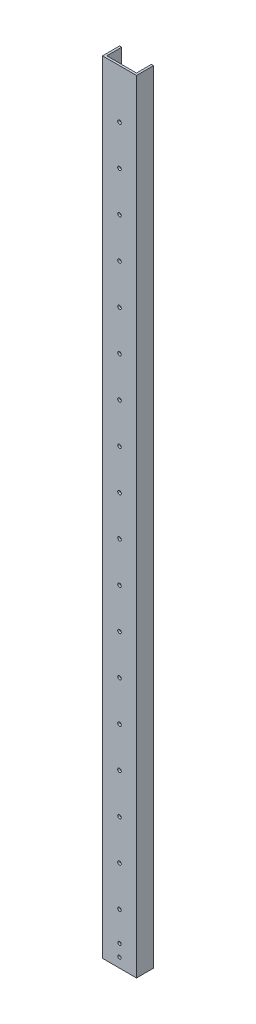
ISO-10303-21;
HEADER;
FILE_DESCRIPTION(('STEP AP214'),'2;1');
FILE_NAME('part.step','',(''),(''),'','','');
FILE_SCHEMA(('AUTOMOTIVE_DESIGN { 1 0 10303 214 1 1 1 1 }'));
ENDSEC;
DATA;
#1=APPLICATION_CONTEXT('core data for automotive mechanical design processes');
#2=APPLICATION_PROTOCOL_DEFINITION('international standard','automotive_design',2000,#1);
#3=PRODUCT_CONTEXT('',#1,'mechanical');
#4=PRODUCT('Part','Part','',(#3));
#5=PRODUCT_RELATED_PRODUCT_CATEGORY('part','',(#4));
#6=PRODUCT_DEFINITION_FORMATION('','',#4);
#7=PRODUCT_DEFINITION_CONTEXT('part definition',#1,'design');
#8=PRODUCT_DEFINITION('design','',#6,#7);
#9=PRODUCT_DEFINITION_SHAPE('','',#8);
#10=(LENGTH_UNIT() NAMED_UNIT(*) SI_UNIT(.MILLI.,.METRE.));
#11=(NAMED_UNIT(*) PLANE_ANGLE_UNIT() SI_UNIT($,.RADIAN.));
#12=(NAMED_UNIT(*) SI_UNIT($,.STERADIAN.) SOLID_ANGLE_UNIT());
#13=UNCERTAINTY_MEASURE_WITH_UNIT(LENGTH_MEASURE(1.E-05),#10,'distance_accuracy_value','');
#14=(GEOMETRIC_REPRESENTATION_CONTEXT(3) GLOBAL_UNCERTAINTY_ASSIGNED_CONTEXT((#13)) GLOBAL_UNIT_ASSIGNED_CONTEXT((#10,
#11,#12)) REPRESENTATION_CONTEXT('',''));
#15=CARTESIAN_POINT('',(0.,0.,0.));
#16=DIRECTION('',(0.,0.,1.));
#17=DIRECTION('',(1.,0.,0.));
#18=AXIS2_PLACEMENT_3D('',#15,#16,#17);
#19=CARTESIAN_POINT('',(0.,1168.4,0.));
#20=DIRECTION('',(1.,0.,0.));
#21=DIRECTION('',(0.,0.,-1.));
#22=AXIS2_PLACEMENT_3D('',#19,#20,#21);
#23=PLANE('',#22);
#24=DIRECTION('',(0.,0.,1.));
#25=VECTOR('',#24,1.);
#26=CARTESIAN_POINT('',(0.,0.,0.));
#27=LINE('',#26,#25);
#28=CARTESIAN_POINT('',(0.,0.,-25.4));
#29=VERTEX_POINT('',#28);
#30=CARTESIAN_POINT('',(0.,0.,0.));
#31=VERTEX_POINT('',#30);
#32=EDGE_CURVE('E147',#29,#31,#27,.T.);
#33=ORIENTED_EDGE('',*,*,#32,.T.);
#34=DIRECTION('',(0.,-1.,0.));
#35=VECTOR('',#34,1.);
#36=CARTESIAN_POINT('',(0.,1168.4,0.));
#37=LINE('',#36,#35);
#38=CARTESIAN_POINT('',(0.,1168.4,0.));
#39=VERTEX_POINT('',#38);
#40=EDGE_CURVE('E12',#39,#31,#37,.T.);
#41=ORIENTED_EDGE('',*,*,#40,.F.);
#42=DIRECTION('',(0.,0.,1.));
#43=VECTOR('',#42,1.);
#44=CARTESIAN_POINT('',(0.,1168.4,0.));
#45=LINE('',#44,#43);
#46=CARTESIAN_POINT('',(0.,1168.4,-25.4));
#47=VERTEX_POINT('',#46);
#48=EDGE_CURVE('E170',#47,#39,#45,.T.);
#49=ORIENTED_EDGE('',*,*,#48,.F.);
#50=DIRECTION('',(0.,-1.,0.));
#51=VECTOR('',#50,1.);
#52=CARTESIAN_POINT('',(0.,1168.4,-25.4));
#53=LINE('',#52,#51);
#54=EDGE_CURVE('E143',#47,#29,#53,.T.);
#55=ORIENTED_EDGE('',*,*,#54,.T.);
#56=EDGE_LOOP('',(#33,#41,#49,#55));
#57=FACE_BOUND('',#56,.T.);
#58=ADVANCED_FACE('F41',(#57),#23,.F.);
#59=CARTESIAN_POINT('',(0.,1168.4,0.));
#60=DIRECTION('',(0.,0.,-1.));
#61=DIRECTION('',(-1.,0.,0.));
#62=AXIS2_PLACEMENT_3D('',#59,#60,#61);
#63=PLANE('',#62);
#64=CARTESIAN_POINT('',(25.4000000000003,32.1310000000016,0.));
#65=DIRECTION('',(0.,0.,1.));
#66=DIRECTION('',(1.,0.,0.));
#67=AXIS2_PLACEMENT_3D('',#64,#65,#66);
#68=CIRCLE('',#67,2.5527);
#69=CARTESIAN_POINT('',(27.9527000000003,32.1310000000016,0.));
#70=VERTEX_POINT('',#69);
#71=EDGE_CURVE('E347',#70,#70,#68,.T.);
#72=ORIENTED_EDGE('',*,*,#71,.F.);
#73=EDGE_LOOP('',(#72));
#74=FACE_BOUND('',#73,.T.);
#75=CARTESIAN_POINT('',(25.4000000000003,14.2875000000016,0.));
#76=DIRECTION('',(0.,0.,1.));
#77=DIRECTION('',(1.,0.,0.));
#78=AXIS2_PLACEMENT_3D('',#75,#76,#77);
#79=CIRCLE('',#78,2.5527);
#80=CARTESIAN_POINT('',(27.9527000000003,14.2875000000016,0.));
#81=VERTEX_POINT('',#80);
#82=EDGE_CURVE('E348',#81,#81,#79,.T.);
#83=ORIENTED_EDGE('',*,*,#82,.F.);
#84=EDGE_LOOP('',(#83));
#85=FACE_BOUND('',#84,.T.);
#86=CARTESIAN_POINT('',(25.4,76.2,0.));
#87=DIRECTION('',(0.,0.,1.));
#88=DIRECTION('',(1.,0.,0.));
#89=AXIS2_PLACEMENT_3D('',#86,#87,#88);
#90=CIRCLE('',#89,2.667);
#91=CARTESIAN_POINT('',(28.067,76.2,0.));
#92=VERTEX_POINT('',#91);
#93=EDGE_CURVE('E338',#92,#92,#90,.T.);
#94=ORIENTED_EDGE('',*,*,#93,.F.);
#95=EDGE_LOOP('',(#94));
#96=FACE_BOUND('',#95,.T.);
#97=CARTESIAN_POINT('',(25.4,136.144,0.));
#98=DIRECTION('',(0.,0.,1.));
#99=DIRECTION('',(1.,0.,0.));
#100=AXIS2_PLACEMENT_3D('',#97,#98,#99);
#101=CIRCLE('',#100,2.667);
#102=CARTESIAN_POINT('',(28.067,136.144,0.));
#103=VERTEX_POINT('',#102);
#104=EDGE_CURVE('E322',#103,#103,#101,.T.);
#105=ORIENTED_EDGE('',*,*,#104,.F.);
#106=EDGE_LOOP('',(#105));
#107=FACE_BOUND('',#106,.T.);
#108=CARTESIAN_POINT('',(25.4,196.088,0.));
#109=DIRECTION('',(0.,0.,1.));
#110=DIRECTION('',(1.,0.,0.));
#111=AXIS2_PLACEMENT_3D('',#108,#109,#110);
#112=CIRCLE('',#111,2.667);
#113=CARTESIAN_POINT('',(28.067,196.088,0.));
#114=VERTEX_POINT('',#113);
#115=EDGE_CURVE('E312',#114,#114,#112,.T.);
#116=ORIENTED_EDGE('',*,*,#115,.F.);
#117=EDGE_LOOP('',(#116));
#118=FACE_BOUND('',#117,.T.);
#119=CARTESIAN_POINT('',(25.4,256.032,0.));
#120=DIRECTION('',(0.,0.,1.));
#121=DIRECTION('',(1.,0.,0.));
#122=AXIS2_PLACEMENT_3D('',#119,#120,#121);
#123=CIRCLE('',#122,2.667);
#124=CARTESIAN_POINT('',(28.067,256.032,0.));
#125=VERTEX_POINT('',#124);
#126=EDGE_CURVE('E313',#125,#125,#123,.T.);
#127=ORIENTED_EDGE('',*,*,#126,.F.);
#128=EDGE_LOOP('',(#127));
#129=FACE_BOUND('',#128,.T.);
#130=CARTESIAN_POINT('',(25.4,315.976,0.));
#131=DIRECTION('',(0.,0.,1.));
#132=DIRECTION('',(1.,0.,0.));
#133=AXIS2_PLACEMENT_3D('',#130,#131,#132);
#134=CIRCLE('',#133,2.667);
#135=CARTESIAN_POINT('',(28.067,315.976,0.));
#136=VERTEX_POINT('',#135);
#137=EDGE_CURVE('E293',#136,#136,#134,.T.);
#138=ORIENTED_EDGE('',*,*,#137,.F.);
#139=EDGE_LOOP('',(#138));
#140=FACE_BOUND('',#139,.T.);
#141=CARTESIAN_POINT('',(25.4,375.92,0.));
#142=DIRECTION('',(0.,0.,1.));
#143=DIRECTION('',(1.,0.,0.));
#144=AXIS2_PLACEMENT_3D('',#141,#142,#143);
#145=CIRCLE('',#144,2.667);
#146=CARTESIAN_POINT('',(28.067,375.92,0.));
#147=VERTEX_POINT('',#146);
#148=EDGE_CURVE('E285',#147,#147,#145,.T.);
#149=ORIENTED_EDGE('',*,*,#148,.F.);
#150=EDGE_LOOP('',(#149));
#151=FACE_BOUND('',#150,.T.);
#152=CARTESIAN_POINT('',(25.4,435.864,0.));
#153=DIRECTION('',(0.,0.,1.));
#154=DIRECTION('',(1.,0.,0.));
#155=AXIS2_PLACEMENT_3D('',#152,#153,#154);
#156=CIRCLE('',#155,2.667);
#157=CARTESIAN_POINT('',(28.067,435.864,0.));
#158=VERTEX_POINT('',#157);
#159=EDGE_CURVE('E277',#158,#158,#156,.T.);
#160=ORIENTED_EDGE('',*,*,#159,.F.);
#161=EDGE_LOOP('',(#160));
#162=FACE_BOUND('',#161,.T.);
#163=CARTESIAN_POINT('',(25.4,495.808,0.));
#164=DIRECTION('',(0.,0.,1.));
#165=DIRECTION('',(1.,0.,0.));
#166=AXIS2_PLACEMENT_3D('',#163,#164,#165);
#167=CIRCLE('',#166,2.667);
#168=CARTESIAN_POINT('',(28.067,495.808,0.));
#169=VERTEX_POINT('',#168);
#170=EDGE_CURVE('E269',#169,#169,#167,.T.);
#171=ORIENTED_EDGE('',*,*,#170,.F.);
#172=EDGE_LOOP('',(#171));
#173=FACE_BOUND('',#172,.T.);
#174=CARTESIAN_POINT('',(25.4,555.752,0.));
#175=DIRECTION('',(0.,0.,1.));
#176=DIRECTION('',(1.,0.,0.));
#177=AXIS2_PLACEMENT_3D('',#174,#175,#176);
#178=CIRCLE('',#177,2.667);
#179=CARTESIAN_POINT('',(28.067,555.752,0.));
#180=VERTEX_POINT('',#179);
#181=EDGE_CURVE('E263',#180,#180,#178,.T.);
#182=ORIENTED_EDGE('',*,*,#181,.F.);
#183=EDGE_LOOP('',(#182));
#184=FACE_BOUND('',#183,.T.);
#185=CARTESIAN_POINT('',(25.4,615.696,0.));
#186=DIRECTION('',(0.,0.,1.));
#187=DIRECTION('',(1.,0.,0.));
#188=AXIS2_PLACEMENT_3D('',#185,#186,#187);
#189=CIRCLE('',#188,2.66699999999997);
#190=CARTESIAN_POINT('',(28.067,615.696,0.));
#191=VERTEX_POINT('',#190);
#192=EDGE_CURVE('E257',#191,#191,#189,.T.);
#193=ORIENTED_EDGE('',*,*,#192,.F.);
#194=EDGE_LOOP('',(#193));
#195=FACE_BOUND('',#194,.T.);
#196=CARTESIAN_POINT('',(25.4,675.64,0.));
#197=DIRECTION('',(0.,0.,1.));
#198=DIRECTION('',(1.,0.,0.));
#199=AXIS2_PLACEMENT_3D('',#196,#197,#198);
#200=CIRCLE('',#199,2.66699999999995);
#201=CARTESIAN_POINT('',(28.0669999999999,675.64,0.));
#202=VERTEX_POINT('',#201);
#203=EDGE_CURVE('E251',#202,#202,#200,.T.);
#204=ORIENTED_EDGE('',*,*,#203,.F.);
#205=EDGE_LOOP('',(#204));
#206=FACE_BOUND('',#205,.T.);
#207=CARTESIAN_POINT('',(25.4,735.584,0.));
#208=DIRECTION('',(0.,0.,1.));
#209=DIRECTION('',(1.,0.,0.));
#210=AXIS2_PLACEMENT_3D('',#207,#208,#209);
#211=CIRCLE('',#210,2.667);
#212=CARTESIAN_POINT('',(28.067,735.584,0.));
#213=VERTEX_POINT('',#212);
#214=EDGE_CURVE('E245',#213,#213,#211,.T.);
#215=ORIENTED_EDGE('',*,*,#214,.F.);
#216=EDGE_LOOP('',(#215));
#217=FACE_BOUND('',#216,.T.);
#218=CARTESIAN_POINT('',(25.4,795.528,0.));
#219=DIRECTION('',(0.,0.,1.));
#220=DIRECTION('',(1.,0.,0.));
#221=AXIS2_PLACEMENT_3D('',#218,#219,#220);
#222=CIRCLE('',#221,2.667);
#223=CARTESIAN_POINT('',(28.067,795.528,0.));
#224=VERTEX_POINT('',#223);
#225=EDGE_CURVE('E239',#224,#224,#222,.T.);
#226=ORIENTED_EDGE('',*,*,#225,.F.);
#227=EDGE_LOOP('',(#226));
#228=FACE_BOUND('',#227,.T.);
#229=CARTESIAN_POINT('',(25.4,855.472,0.));
#230=DIRECTION('',(0.,0.,1.));
#231=DIRECTION('',(1.,0.,0.));
#232=AXIS2_PLACEMENT_3D('',#229,#230,#231);
#233=CIRCLE('',#232,2.667);
#234=CARTESIAN_POINT('',(28.067,855.472,0.));
#235=VERTEX_POINT('',#234);
#236=EDGE_CURVE('E233',#235,#235,#233,.T.);
#237=ORIENTED_EDGE('',*,*,#236,.F.);
#238=EDGE_LOOP('',(#237));
#239=FACE_BOUND('',#238,.T.);
#240=CARTESIAN_POINT('',(25.4,915.416,0.));
#241=DIRECTION('',(0.,0.,1.));
#242=DIRECTION('',(1.,0.,0.));
#243=AXIS2_PLACEMENT_3D('',#240,#241,#242);
#244=CIRCLE('',#243,2.667);
#245=CARTESIAN_POINT('',(28.067,915.416,0.));
#246=VERTEX_POINT('',#245);
#247=EDGE_CURVE('E227',#246,#246,#244,.T.);
#248=ORIENTED_EDGE('',*,*,#247,.F.);
#249=EDGE_LOOP('',(#248));
#250=FACE_BOUND('',#249,.T.);
#251=CARTESIAN_POINT('',(25.4,975.36,0.));
#252=DIRECTION('',(0.,0.,1.));
#253=DIRECTION('',(1.,0.,0.));
#254=AXIS2_PLACEMENT_3D('',#251,#252,#253);
#255=CIRCLE('',#254,2.66700000000003);
#256=CARTESIAN_POINT('',(28.067,975.36,0.));
#257=VERTEX_POINT('',#256);
#258=EDGE_CURVE('E221',#257,#257,#255,.T.);
#259=ORIENTED_EDGE('',*,*,#258,.F.);
#260=EDGE_LOOP('',(#259));
#261=FACE_BOUND('',#260,.T.);
#262=CARTESIAN_POINT('',(25.4,1035.304,0.));
#263=DIRECTION('',(0.,0.,1.));
#264=DIRECTION('',(1.,0.,0.));
#265=AXIS2_PLACEMENT_3D('',#262,#263,#264);
#266=CIRCLE('',#265,2.66700000000006);
#267=CARTESIAN_POINT('',(28.0670000000001,1035.304,0.));
#268=VERTEX_POINT('',#267);
#269=EDGE_CURVE('E213',#268,#268,#266,.T.);
#270=ORIENTED_EDGE('',*,*,#269,.F.);
#271=EDGE_LOOP('',(#270));
#272=FACE_BOUND('',#271,.T.);
#273=CARTESIAN_POINT('',(25.4,1095.248,0.));
#274=DIRECTION('',(0.,0.,1.));
#275=DIRECTION('',(1.,0.,0.));
#276=AXIS2_PLACEMENT_3D('',#273,#274,#275);
#277=CIRCLE('',#276,2.66700000000006);
#278=CARTESIAN_POINT('',(28.0670000000001,1095.248,0.));
#279=VERTEX_POINT('',#278);
#280=EDGE_CURVE('E214',#279,#279,#277,.T.);
#281=ORIENTED_EDGE('',*,*,#280,.F.);
#282=EDGE_LOOP('',(#281));
#283=FACE_BOUND('',#282,.T.);
#284=DIRECTION('',(1.,0.,0.));
#285=VECTOR('',#284,1.);
#286=CARTESIAN_POINT('',(0.,0.,0.));
#287=LINE('',#286,#285);
#288=CARTESIAN_POINT('',(50.8,0.,0.));
#289=VERTEX_POINT('',#288);
#290=EDGE_CURVE('E151',#31,#289,#287,.T.);
#291=ORIENTED_EDGE('',*,*,#290,.T.);
#292=DIRECTION('',(0.,-1.,0.));
#293=VECTOR('',#292,1.);
#294=CARTESIAN_POINT('',(50.8,1168.4,0.));
#295=LINE('',#294,#293);
#296=CARTESIAN_POINT('',(50.8,1168.4,0.));
#297=VERTEX_POINT('',#296);
#298=EDGE_CURVE('E50',#297,#289,#295,.T.);
#299=ORIENTED_EDGE('',*,*,#298,.F.);
#300=DIRECTION('',(1.,0.,0.));
#301=VECTOR('',#300,1.);
#302=CARTESIAN_POINT('',(0.,1168.4,0.));
#303=LINE('',#302,#301);
#304=EDGE_CURVE('E109',#39,#297,#303,.T.);
#305=ORIENTED_EDGE('',*,*,#304,.F.);
#306=ORIENTED_EDGE('',*,*,#40,.T.);
#307=EDGE_LOOP('',(#291,#299,#305,#306));
#308=FACE_BOUND('',#307,.T.);
#309=ADVANCED_FACE('F362',(#74,#85,#96,#107,#118,#129,#140,#151,#162,#173,#184,#195,#206,#217,
#228,#239,#250,#261,#272,#283,#308),#63,.F.);
#310=CARTESIAN_POINT('',(50.8,1168.4,0.));
#311=DIRECTION('',(-1.,0.,0.));
#312=DIRECTION('',(0.,0.,1.));
#313=AXIS2_PLACEMENT_3D('',#310,#311,#312);
#314=PLANE('',#313);
#315=DIRECTION('',(0.,0.,-1.));
#316=VECTOR('',#315,1.);
#317=CARTESIAN_POINT('',(50.8,0.,0.));
#318=LINE('',#317,#316);
#319=CARTESIAN_POINT('',(50.8,0.,-25.4));
#320=VERTEX_POINT('',#319);
#321=EDGE_CURVE('E155',#289,#320,#318,.T.);
#322=ORIENTED_EDGE('',*,*,#321,.T.);
#323=DIRECTION('',(0.,-1.,0.));
#324=VECTOR('',#323,1.);
#325=CARTESIAN_POINT('',(50.8,1168.4,-25.4));
#326=LINE('',#325,#324);
#327=CARTESIAN_POINT('',(50.8,1168.4,-25.4));
#328=VERTEX_POINT('',#327);
#329=EDGE_CURVE('E181',#328,#320,#326,.T.);
#330=ORIENTED_EDGE('',*,*,#329,.F.);
#331=DIRECTION('',(0.,0.,-1.));
#332=VECTOR('',#331,1.);
#333=CARTESIAN_POINT('',(50.8,1168.4,0.));
#334=LINE('',#333,#332);
#335=EDGE_CURVE('E192',#297,#328,#334,.T.);
#336=ORIENTED_EDGE('',*,*,#335,.F.);
#337=ORIENTED_EDGE('',*,*,#298,.T.);
#338=EDGE_LOOP('',(#322,#330,#336,#337));
#339=FACE_BOUND('',#338,.T.);
#340=ADVANCED_FACE('F190',(#339),#314,.F.);
#341=CARTESIAN_POINT('',(50.8,1168.4,-25.4));
#342=DIRECTION('',(0.,0.,1.));
#343=DIRECTION('',(1.,0.,0.));
#344=AXIS2_PLACEMENT_3D('',#341,#342,#343);
#345=PLANE('',#344);
#346=DIRECTION('',(-1.,0.,0.));
#347=VECTOR('',#346,1.);
#348=CARTESIAN_POINT('',(50.8,0.,-25.4));
#349=LINE('',#348,#347);
#350=CARTESIAN_POINT('',(47.625,0.,-25.4));
#351=VERTEX_POINT('',#350);
#352=EDGE_CURVE('E158',#320,#351,#349,.T.);
#353=ORIENTED_EDGE('',*,*,#352,.T.);
#354=DIRECTION('',(0.,-1.,0.));
#355=VECTOR('',#354,1.);
#356=CARTESIAN_POINT('',(47.625,1168.4,-25.4));
#357=LINE('',#356,#355);
#358=CARTESIAN_POINT('',(47.625,1168.4,-25.4));
#359=VERTEX_POINT('',#358);
#360=EDGE_CURVE('E177',#359,#351,#357,.T.);
#361=ORIENTED_EDGE('',*,*,#360,.F.);
#362=DIRECTION('',(-1.,0.,0.));
#363=VECTOR('',#362,1.);
#364=CARTESIAN_POINT('',(50.8,1168.4,-25.4));
#365=LINE('',#364,#363);
#366=EDGE_CURVE('E204',#328,#359,#365,.T.);
#367=ORIENTED_EDGE('',*,*,#366,.F.);
#368=ORIENTED_EDGE('',*,*,#329,.T.);
#369=EDGE_LOOP('',(#353,#361,#367,#368));
#370=FACE_BOUND('',#369,.T.);
#371=ADVANCED_FACE('F200',(#370),#345,.F.);
#372=CARTESIAN_POINT('',(47.625,1168.4,-3.175));
#373=DIRECTION('',(1.,0.,0.));
#374=DIRECTION('',(0.,0.,-1.));
#375=AXIS2_PLACEMENT_3D('',#372,#373,#374);
#376=PLANE('',#375);
#377=DIRECTION('',(0.,0.,1.));
#378=VECTOR('',#377,1.);
#379=CARTESIAN_POINT('',(47.625,0.,-3.175));
#380=LINE('',#379,#378);
#381=CARTESIAN_POINT('',(47.625,0.,-3.175));
#382=VERTEX_POINT('',#381);
#383=EDGE_CURVE('E161',#351,#382,#380,.T.);
#384=ORIENTED_EDGE('',*,*,#383,.T.);
#385=DIRECTION('',(0.,-1.,0.));
#386=VECTOR('',#385,1.);
#387=CARTESIAN_POINT('',(47.625,1168.4,-3.175));
#388=LINE('',#387,#386);
#389=CARTESIAN_POINT('',(47.625,1168.4,-3.175));
#390=VERTEX_POINT('',#389);
#391=EDGE_CURVE('E138',#390,#382,#388,.T.);
#392=ORIENTED_EDGE('',*,*,#391,.F.);
#393=DIRECTION('',(0.,0.,1.));
#394=VECTOR('',#393,1.);
#395=CARTESIAN_POINT('',(47.625,1168.4,-3.175));
#396=LINE('',#395,#394);
#397=EDGE_CURVE('E128',#359,#390,#396,.T.);
#398=ORIENTED_EDGE('',*,*,#397,.F.);
#399=ORIENTED_EDGE('',*,*,#360,.T.);
#400=EDGE_LOOP('',(#384,#392,#398,#399));
#401=FACE_BOUND('',#400,.T.);
#402=ADVANCED_FACE('F203',(#401),#376,.F.);
#403=CARTESIAN_POINT('',(3.175,1168.4,-3.175));
#404=DIRECTION('',(0.,0.,1.));
#405=DIRECTION('',(1.,0.,0.));
#406=AXIS2_PLACEMENT_3D('',#403,#404,#405);
#407=PLANE('',#406);
#408=CARTESIAN_POINT('',(25.4000000000003,32.1310000000016,-3.175));
#409=DIRECTION('',(0.,0.,1.));
#410=DIRECTION('',(1.,0.,0.));
#411=AXIS2_PLACEMENT_3D('',#408,#409,#410);
#412=CIRCLE('',#411,2.5527);
#413=CARTESIAN_POINT('',(27.9527000000003,32.1310000000016,-3.175));
#414=VERTEX_POINT('',#413);
#415=EDGE_CURVE('E217',#414,#414,#412,.F.);
#416=ORIENTED_EDGE('',*,*,#415,.F.);
#417=EDGE_LOOP('',(#416));
#418=FACE_BOUND('',#417,.T.);
#419=CARTESIAN_POINT('',(25.4000000000003,14.2875000000016,-3.175));
#420=DIRECTION('',(0.,0.,1.));
#421=DIRECTION('',(1.,0.,0.));
#422=AXIS2_PLACEMENT_3D('',#419,#420,#421);
#423=CIRCLE('',#422,2.5527);
#424=CARTESIAN_POINT('',(27.9527000000003,14.2875000000016,-3.175));
#425=VERTEX_POINT('',#424);
#426=EDGE_CURVE('E343',#425,#425,#423,.F.);
#427=ORIENTED_EDGE('',*,*,#426,.F.);
#428=EDGE_LOOP('',(#427));
#429=FACE_BOUND('',#428,.T.);
#430=CARTESIAN_POINT('',(25.4,76.2,-3.175));
#431=DIRECTION('',(0.,0.,1.));
#432=DIRECTION('',(1.,0.,0.));
#433=AXIS2_PLACEMENT_3D('',#430,#431,#432);
#434=CIRCLE('',#433,2.667);
#435=CARTESIAN_POINT('',(28.067,76.2,-3.175));
#436=VERTEX_POINT('',#435);
#437=EDGE_CURVE('E152',#436,#436,#434,.F.);
#438=ORIENTED_EDGE('',*,*,#437,.F.);
#439=EDGE_LOOP('',(#438));
#440=FACE_BOUND('',#439,.T.);
#441=CARTESIAN_POINT('',(25.4,136.144,-3.175));
#442=DIRECTION('',(0.,0.,1.));
#443=DIRECTION('',(1.,0.,0.));
#444=AXIS2_PLACEMENT_3D('',#441,#442,#443);
#445=CIRCLE('',#444,2.667);
#446=CARTESIAN_POINT('',(28.067,136.144,-3.175));
#447=VERTEX_POINT('',#446);
#448=EDGE_CURVE('E327',#447,#447,#445,.F.);
#449=ORIENTED_EDGE('',*,*,#448,.F.);
#450=EDGE_LOOP('',(#449));
#451=FACE_BOUND('',#450,.T.);
#452=CARTESIAN_POINT('',(25.4,196.088,-3.175));
#453=DIRECTION('',(0.,0.,1.));
#454=DIRECTION('',(1.,0.,0.));
#455=AXIS2_PLACEMENT_3D('',#452,#453,#454);
#456=CIRCLE('',#455,2.667);
#457=CARTESIAN_POINT('',(28.067,196.088,-3.175));
#458=VERTEX_POINT('',#457);
#459=EDGE_CURVE('E318',#458,#458,#456,.F.);
#460=ORIENTED_EDGE('',*,*,#459,.F.);
#461=EDGE_LOOP('',(#460));
#462=FACE_BOUND('',#461,.T.);
#463=CARTESIAN_POINT('',(25.4,256.032,-3.175));
#464=DIRECTION('',(0.,0.,1.));
#465=DIRECTION('',(1.,0.,0.));
#466=AXIS2_PLACEMENT_3D('',#463,#464,#465);
#467=CIRCLE('',#466,2.667);
#468=CARTESIAN_POINT('',(28.067,256.032,-3.175));
#469=VERTEX_POINT('',#468);
#470=EDGE_CURVE('E309',#469,#469,#467,.F.);
#471=ORIENTED_EDGE('',*,*,#470,.F.);
#472=EDGE_LOOP('',(#471));
#473=FACE_BOUND('',#472,.T.);
#474=CARTESIAN_POINT('',(25.4,315.976,-3.175));
#475=DIRECTION('',(0.,0.,1.));
#476=DIRECTION('',(1.,0.,0.));
#477=AXIS2_PLACEMENT_3D('',#474,#475,#476);
#478=CIRCLE('',#477,2.667);
#479=CARTESIAN_POINT('',(28.067,315.976,-3.175));
#480=VERTEX_POINT('',#479);
#481=EDGE_CURVE('E298',#480,#480,#478,.F.);
#482=ORIENTED_EDGE('',*,*,#481,.F.);
#483=EDGE_LOOP('',(#482));
#484=FACE_BOUND('',#483,.T.);
#485=CARTESIAN_POINT('',(25.4,375.92,-3.175));
#486=DIRECTION('',(0.,0.,1.));
#487=DIRECTION('',(1.,0.,0.));
#488=AXIS2_PLACEMENT_3D('',#485,#486,#487);
#489=CIRCLE('',#488,2.667);
#490=CARTESIAN_POINT('',(28.067,375.92,-3.175));
#491=VERTEX_POINT('',#490);
#492=EDGE_CURVE('E289',#491,#491,#489,.F.);
#493=ORIENTED_EDGE('',*,*,#492,.F.);
#494=EDGE_LOOP('',(#493));
#495=FACE_BOUND('',#494,.T.);
#496=CARTESIAN_POINT('',(25.4,435.864,-3.175));
#497=DIRECTION('',(0.,0.,1.));
#498=DIRECTION('',(1.,0.,0.));
#499=AXIS2_PLACEMENT_3D('',#496,#497,#498);
#500=CIRCLE('',#499,2.667);
#501=CARTESIAN_POINT('',(28.067,435.864,-3.175));
#502=VERTEX_POINT('',#501);
#503=EDGE_CURVE('E281',#502,#502,#500,.F.);
#504=ORIENTED_EDGE('',*,*,#503,.F.);
#505=EDGE_LOOP('',(#504));
#506=FACE_BOUND('',#505,.T.);
#507=CARTESIAN_POINT('',(25.4,495.808,-3.175));
#508=DIRECTION('',(0.,0.,1.));
#509=DIRECTION('',(1.,0.,0.));
#510=AXIS2_PLACEMENT_3D('',#507,#508,#509);
#511=CIRCLE('',#510,2.667);
#512=CARTESIAN_POINT('',(28.067,495.808,-3.175));
#513=VERTEX_POINT('',#512);
#514=EDGE_CURVE('E273',#513,#513,#511,.F.);
#515=ORIENTED_EDGE('',*,*,#514,.F.);
#516=EDGE_LOOP('',(#515));
#517=FACE_BOUND('',#516,.T.);
#518=CARTESIAN_POINT('',(25.4,555.752,-3.175));
#519=DIRECTION('',(0.,0.,1.));
#520=DIRECTION('',(1.,0.,0.));
#521=AXIS2_PLACEMENT_3D('',#518,#519,#520);
#522=CIRCLE('',#521,2.667);
#523=CARTESIAN_POINT('',(28.067,555.752,-3.175));
#524=VERTEX_POINT('',#523);
#525=EDGE_CURVE('E266',#524,#524,#522,.F.);
#526=ORIENTED_EDGE('',*,*,#525,.F.);
#527=EDGE_LOOP('',(#526));
#528=FACE_BOUND('',#527,.T.);
#529=CARTESIAN_POINT('',(25.4,615.696,-3.175));
#530=DIRECTION('',(0.,0.,1.));
#531=DIRECTION('',(1.,0.,0.));
#532=AXIS2_PLACEMENT_3D('',#529,#530,#531);
#533=CIRCLE('',#532,2.66699999999997);
#534=CARTESIAN_POINT('',(28.067,615.696,-3.175));
#535=VERTEX_POINT('',#534);
#536=EDGE_CURVE('E260',#535,#535,#533,.F.);
#537=ORIENTED_EDGE('',*,*,#536,.F.);
#538=EDGE_LOOP('',(#537));
#539=FACE_BOUND('',#538,.T.);
#540=CARTESIAN_POINT('',(25.4,675.64,-3.175));
#541=DIRECTION('',(0.,0.,1.));
#542=DIRECTION('',(1.,0.,0.));
#543=AXIS2_PLACEMENT_3D('',#540,#541,#542);
#544=CIRCLE('',#543,2.66699999999995);
#545=CARTESIAN_POINT('',(28.0669999999999,675.64,-3.175));
#546=VERTEX_POINT('',#545);
#547=EDGE_CURVE('E254',#546,#546,#544,.F.);
#548=ORIENTED_EDGE('',*,*,#547,.F.);
#549=EDGE_LOOP('',(#548));
#550=FACE_BOUND('',#549,.T.);
#551=CARTESIAN_POINT('',(25.4,735.584,-3.175));
#552=DIRECTION('',(0.,0.,1.));
#553=DIRECTION('',(1.,0.,0.));
#554=AXIS2_PLACEMENT_3D('',#551,#552,#553);
#555=CIRCLE('',#554,2.667);
#556=CARTESIAN_POINT('',(28.067,735.584,-3.175));
#557=VERTEX_POINT('',#556);
#558=EDGE_CURVE('E248',#557,#557,#555,.F.);
#559=ORIENTED_EDGE('',*,*,#558,.F.);
#560=EDGE_LOOP('',(#559));
#561=FACE_BOUND('',#560,.T.);
#562=CARTESIAN_POINT('',(25.4,795.528,-3.175));
#563=DIRECTION('',(0.,0.,1.));
#564=DIRECTION('',(1.,0.,0.));
#565=AXIS2_PLACEMENT_3D('',#562,#563,#564);
#566=CIRCLE('',#565,2.667);
#567=CARTESIAN_POINT('',(28.067,795.528,-3.175));
#568=VERTEX_POINT('',#567);
#569=EDGE_CURVE('E242',#568,#568,#566,.F.);
#570=ORIENTED_EDGE('',*,*,#569,.F.);
#571=EDGE_LOOP('',(#570));
#572=FACE_BOUND('',#571,.T.);
#573=CARTESIAN_POINT('',(25.4,855.472,-3.175));
#574=DIRECTION('',(0.,0.,1.));
#575=DIRECTION('',(1.,0.,0.));
#576=AXIS2_PLACEMENT_3D('',#573,#574,#575);
#577=CIRCLE('',#576,2.667);
#578=CARTESIAN_POINT('',(28.067,855.472,-3.175));
#579=VERTEX_POINT('',#578);
#580=EDGE_CURVE('E236',#579,#579,#577,.F.);
#581=ORIENTED_EDGE('',*,*,#580,.F.);
#582=EDGE_LOOP('',(#581));
#583=FACE_BOUND('',#582,.T.);
#584=CARTESIAN_POINT('',(25.4,915.416,-3.175));
#585=DIRECTION('',(0.,0.,1.));
#586=DIRECTION('',(1.,0.,0.));
#587=AXIS2_PLACEMENT_3D('',#584,#585,#586);
#588=CIRCLE('',#587,2.667);
#589=CARTESIAN_POINT('',(28.067,915.416,-3.175));
#590=VERTEX_POINT('',#589);
#591=EDGE_CURVE('E230',#590,#590,#588,.F.);
#592=ORIENTED_EDGE('',*,*,#591,.F.);
#593=EDGE_LOOP('',(#592));
#594=FACE_BOUND('',#593,.T.);
#595=CARTESIAN_POINT('',(25.4,975.36,-3.175));
#596=DIRECTION('',(0.,0.,1.));
#597=DIRECTION('',(1.,0.,0.));
#598=AXIS2_PLACEMENT_3D('',#595,#596,#597);
#599=CIRCLE('',#598,2.66700000000003);
#600=CARTESIAN_POINT('',(28.067,975.36,-3.175));
#601=VERTEX_POINT('',#600);
#602=EDGE_CURVE('E224',#601,#601,#599,.F.);
#603=ORIENTED_EDGE('',*,*,#602,.F.);
#604=EDGE_LOOP('',(#603));
#605=FACE_BOUND('',#604,.T.);
#606=CARTESIAN_POINT('',(25.4,1035.304,-3.175));
#607=DIRECTION('',(0.,0.,1.));
#608=DIRECTION('',(1.,0.,0.));
#609=AXIS2_PLACEMENT_3D('',#606,#607,#608);
#610=CIRCLE('',#609,2.66700000000006);
#611=CARTESIAN_POINT('',(28.0670000000001,1035.304,-3.175));
#612=VERTEX_POINT('',#611);
#613=EDGE_CURVE('E218',#612,#612,#610,.F.);
#614=ORIENTED_EDGE('',*,*,#613,.F.);
#615=EDGE_LOOP('',(#614));
#616=FACE_BOUND('',#615,.T.);
#617=CARTESIAN_POINT('',(25.4,1095.248,-3.175));
#618=DIRECTION('',(0.,0.,1.));
#619=DIRECTION('',(1.,0.,0.));
#620=AXIS2_PLACEMENT_3D('',#617,#618,#619);
#621=CIRCLE('',#620,2.66700000000006);
#622=CARTESIAN_POINT('',(28.0670000000001,1095.248,-3.175));
#623=VERTEX_POINT('',#622);
#624=EDGE_CURVE('E210',#623,#623,#621,.F.);
#625=ORIENTED_EDGE('',*,*,#624,.F.);
#626=EDGE_LOOP('',(#625));
#627=FACE_BOUND('',#626,.T.);
#628=DIRECTION('',(-1.,0.,0.));
#629=VECTOR('',#628,1.);
#630=CARTESIAN_POINT('',(3.175,0.,-3.175));
#631=LINE('',#630,#629);
#632=CARTESIAN_POINT('',(3.175,0.,-3.175));
#633=VERTEX_POINT('',#632);
#634=EDGE_CURVE('E136',#382,#633,#631,.T.);
#635=ORIENTED_EDGE('',*,*,#634,.T.);
#636=DIRECTION('',(0.,-1.,0.));
#637=VECTOR('',#636,1.);
#638=CARTESIAN_POINT('',(3.175,1168.4,-3.175));
#639=LINE('',#638,#637);
#640=CARTESIAN_POINT('',(3.175,1168.4,-3.175));
#641=VERTEX_POINT('',#640);
#642=EDGE_CURVE('E133',#641,#633,#639,.T.);
#643=ORIENTED_EDGE('',*,*,#642,.F.);
#644=DIRECTION('',(-1.,0.,0.));
#645=VECTOR('',#644,1.);
#646=CARTESIAN_POINT('',(3.175,1168.4,-3.175));
#647=LINE('',#646,#645);
#648=EDGE_CURVE('E122',#390,#641,#647,.T.);
#649=ORIENTED_EDGE('',*,*,#648,.F.);
#650=ORIENTED_EDGE('',*,*,#391,.T.);
#651=EDGE_LOOP('',(#635,#643,#649,#650));
#652=FACE_BOUND('',#651,.T.);
#653=ADVANCED_FACE('F134',(#418,#429,#440,#451,#462,#473,#484,#495,#506,#517,#528,#539,#550,
#561,#572,#583,#594,#605,#616,#627,#652),#407,.F.);
#654=CARTESIAN_POINT('',(3.175,1168.4,-3.175));
#655=DIRECTION('',(-1.,0.,0.));
#656=DIRECTION('',(0.,0.,1.));
#657=AXIS2_PLACEMENT_3D('',#654,#655,#656);
#658=PLANE('',#657);
#659=DIRECTION('',(0.,0.,-1.));
#660=VECTOR('',#659,1.);
#661=CARTESIAN_POINT('',(3.175,0.,-3.175));
#662=LINE('',#661,#660);
#663=CARTESIAN_POINT('',(3.175,0.,-25.4));
#664=VERTEX_POINT('',#663);
#665=EDGE_CURVE('E95',#633,#664,#662,.T.);
#666=ORIENTED_EDGE('',*,*,#665,.T.);
#667=DIRECTION('',(0.,-1.,0.));
#668=VECTOR('',#667,1.);
#669=CARTESIAN_POINT('',(3.175,1168.4,-25.4));
#670=LINE('',#669,#668);
#671=CARTESIAN_POINT('',(3.175,1168.4,-25.4));
#672=VERTEX_POINT('',#671);
#673=EDGE_CURVE('E139',#672,#664,#670,.T.);
#674=ORIENTED_EDGE('',*,*,#673,.F.);
#675=DIRECTION('',(0.,0.,-1.));
#676=VECTOR('',#675,1.);
#677=CARTESIAN_POINT('',(3.175,1168.4,-3.175));
#678=LINE('',#677,#676);
#679=EDGE_CURVE('E126',#641,#672,#678,.T.);
#680=ORIENTED_EDGE('',*,*,#679,.F.);
#681=ORIENTED_EDGE('',*,*,#642,.T.);
#682=EDGE_LOOP('',(#666,#674,#680,#681));
#683=FACE_BOUND('',#682,.T.);
#684=ADVANCED_FACE('F141',(#683),#658,.F.);
#685=CARTESIAN_POINT('',(0.,1168.4,-25.4));
#686=DIRECTION('',(0.,0.,1.));
#687=DIRECTION('',(1.,0.,0.));
#688=AXIS2_PLACEMENT_3D('',#685,#686,#687);
#689=PLANE('',#688);
#690=DIRECTION('',(-1.,0.,0.));
#691=VECTOR('',#690,1.);
#692=CARTESIAN_POINT('',(0.,0.,-25.4));
#693=LINE('',#692,#691);
#694=EDGE_CURVE('E101',#664,#29,#693,.T.);
#695=ORIENTED_EDGE('',*,*,#694,.T.);
#696=ORIENTED_EDGE('',*,*,#54,.F.);
#697=DIRECTION('',(-1.,0.,0.));
#698=VECTOR('',#697,1.);
#699=CARTESIAN_POINT('',(0.,1168.4,-25.4));
#700=LINE('',#699,#698);
#701=EDGE_CURVE('E58',#672,#47,#700,.T.);
#702=ORIENTED_EDGE('',*,*,#701,.F.);
#703=ORIENTED_EDGE('',*,*,#673,.T.);
#704=EDGE_LOOP('',(#695,#696,#702,#703));
#705=FACE_BOUND('',#704,.T.);
#706=ADVANCED_FACE('F405',(#705),#689,.F.);
#707=CARTESIAN_POINT('',(0.,1168.4,0.));
#708=DIRECTION('',(0.,-1.,0.));
#709=DIRECTION('',(0.,0.,-1.));
#710=AXIS2_PLACEMENT_3D('',#707,#708,#709);
#711=PLANE('',#710);
#712=ORIENTED_EDGE('',*,*,#48,.T.);
#713=ORIENTED_EDGE('',*,*,#304,.T.);
#714=ORIENTED_EDGE('',*,*,#335,.T.);
#715=ORIENTED_EDGE('',*,*,#366,.T.);
#716=ORIENTED_EDGE('',*,*,#397,.T.);
#717=ORIENTED_EDGE('',*,*,#648,.T.);
#718=ORIENTED_EDGE('',*,*,#679,.T.);
#719=ORIENTED_EDGE('',*,*,#701,.T.);
#720=EDGE_LOOP('',(#712,#713,#714,#715,#716,#717,#718,#719));
#721=FACE_BOUND('',#720,.T.);
#722=ADVANCED_FACE('F124',(#721),#711,.F.);
#723=CARTESIAN_POINT('',(0.,0.,0.));
#724=DIRECTION('',(0.,-1.,0.));
#725=DIRECTION('',(0.,0.,-1.));
#726=AXIS2_PLACEMENT_3D('',#723,#724,#725);
#727=PLANE('',#726);
#728=ORIENTED_EDGE('',*,*,#32,.F.);
#729=ORIENTED_EDGE('',*,*,#694,.F.);
#730=ORIENTED_EDGE('',*,*,#665,.F.);
#731=ORIENTED_EDGE('',*,*,#634,.F.);
#732=ORIENTED_EDGE('',*,*,#383,.F.);
#733=ORIENTED_EDGE('',*,*,#352,.F.);
#734=ORIENTED_EDGE('',*,*,#321,.F.);
#735=ORIENTED_EDGE('',*,*,#290,.F.);
#736=EDGE_LOOP('',(#728,#729,#730,#731,#732,#733,#734,#735));
#737=FACE_BOUND('',#736,.T.);
#738=ADVANCED_FACE('F196',(#737),#727,.T.);
#739=CARTESIAN_POINT('',(25.4,1095.248,-25.401));
#740=DIRECTION('',(0.,0.,1.));
#741=DIRECTION('',(1.,0.,0.));
#742=AXIS2_PLACEMENT_3D('',#739,#740,#741);
#743=CYLINDRICAL_SURFACE('',#742,2.66700000000006);
#744=ORIENTED_EDGE('',*,*,#280,.T.);
#745=EDGE_LOOP('',(#744));
#746=FACE_BOUND('',#745,.T.);
#747=ORIENTED_EDGE('',*,*,#624,.T.);
#748=EDGE_LOOP('',(#747));
#749=FACE_BOUND('',#748,.T.);
#750=ADVANCED_FACE('F469',(#746,#749),#743,.F.);
#751=CARTESIAN_POINT('',(25.4,1035.304,-25.401));
#752=DIRECTION('',(0.,0.,1.));
#753=DIRECTION('',(1.,0.,0.));
#754=AXIS2_PLACEMENT_3D('',#751,#752,#753);
#755=CYLINDRICAL_SURFACE('',#754,2.66700000000006);
#756=ORIENTED_EDGE('',*,*,#269,.T.);
#757=EDGE_LOOP('',(#756));
#758=FACE_BOUND('',#757,.T.);
#759=ORIENTED_EDGE('',*,*,#613,.T.);
#760=EDGE_LOOP('',(#759));
#761=FACE_BOUND('',#760,.T.);
#762=ADVANCED_FACE('F477',(#758,#761),#755,.F.);
#763=CARTESIAN_POINT('',(25.4,975.36,-25.401));
#764=DIRECTION('',(0.,0.,1.));
#765=DIRECTION('',(1.,0.,0.));
#766=AXIS2_PLACEMENT_3D('',#763,#764,#765);
#767=CYLINDRICAL_SURFACE('',#766,2.66700000000003);
#768=ORIENTED_EDGE('',*,*,#258,.T.);
#769=EDGE_LOOP('',(#768));
#770=FACE_BOUND('',#769,.T.);
#771=ORIENTED_EDGE('',*,*,#602,.T.);
#772=EDGE_LOOP('',(#771));
#773=FACE_BOUND('',#772,.T.);
#774=ADVANCED_FACE('F487',(#770,#773),#767,.F.);
#775=CARTESIAN_POINT('',(25.4,915.416,-25.401));
#776=DIRECTION('',(0.,0.,1.));
#777=DIRECTION('',(1.,0.,0.));
#778=AXIS2_PLACEMENT_3D('',#775,#776,#777);
#779=CYLINDRICAL_SURFACE('',#778,2.667);
#780=ORIENTED_EDGE('',*,*,#247,.T.);
#781=EDGE_LOOP('',(#780));
#782=FACE_BOUND('',#781,.T.);
#783=ORIENTED_EDGE('',*,*,#591,.T.);
#784=EDGE_LOOP('',(#783));
#785=FACE_BOUND('',#784,.T.);
#786=ADVANCED_FACE('F497',(#782,#785),#779,.F.);
#787=CARTESIAN_POINT('',(25.4,855.472,-25.401));
#788=DIRECTION('',(0.,0.,1.));
#789=DIRECTION('',(1.,0.,0.));
#790=AXIS2_PLACEMENT_3D('',#787,#788,#789);
#791=CYLINDRICAL_SURFACE('',#790,2.667);
#792=ORIENTED_EDGE('',*,*,#236,.T.);
#793=EDGE_LOOP('',(#792));
#794=FACE_BOUND('',#793,.T.);
#795=ORIENTED_EDGE('',*,*,#580,.T.);
#796=EDGE_LOOP('',(#795));
#797=FACE_BOUND('',#796,.T.);
#798=ADVANCED_FACE('F507',(#794,#797),#791,.F.);
#799=CARTESIAN_POINT('',(25.4,795.528,-25.401));
#800=DIRECTION('',(0.,0.,1.));
#801=DIRECTION('',(1.,0.,0.));
#802=AXIS2_PLACEMENT_3D('',#799,#800,#801);
#803=CYLINDRICAL_SURFACE('',#802,2.667);
#804=ORIENTED_EDGE('',*,*,#225,.T.);
#805=EDGE_LOOP('',(#804));
#806=FACE_BOUND('',#805,.T.);
#807=ORIENTED_EDGE('',*,*,#569,.T.);
#808=EDGE_LOOP('',(#807));
#809=FACE_BOUND('',#808,.T.);
#810=ADVANCED_FACE('F517',(#806,#809),#803,.F.);
#811=CARTESIAN_POINT('',(25.4,735.584,-25.401));
#812=DIRECTION('',(0.,0.,1.));
#813=DIRECTION('',(1.,0.,0.));
#814=AXIS2_PLACEMENT_3D('',#811,#812,#813);
#815=CYLINDRICAL_SURFACE('',#814,2.667);
#816=ORIENTED_EDGE('',*,*,#214,.T.);
#817=EDGE_LOOP('',(#816));
#818=FACE_BOUND('',#817,.T.);
#819=ORIENTED_EDGE('',*,*,#558,.T.);
#820=EDGE_LOOP('',(#819));
#821=FACE_BOUND('',#820,.T.);
#822=ADVANCED_FACE('F527',(#818,#821),#815,.F.);
#823=CARTESIAN_POINT('',(25.4,675.64,-25.401));
#824=DIRECTION('',(0.,0.,1.));
#825=DIRECTION('',(1.,0.,0.));
#826=AXIS2_PLACEMENT_3D('',#823,#824,#825);
#827=CYLINDRICAL_SURFACE('',#826,2.66699999999995);
#828=ORIENTED_EDGE('',*,*,#203,.T.);
#829=EDGE_LOOP('',(#828));
#830=FACE_BOUND('',#829,.T.);
#831=ORIENTED_EDGE('',*,*,#547,.T.);
#832=EDGE_LOOP('',(#831));
#833=FACE_BOUND('',#832,.T.);
#834=ADVANCED_FACE('F537',(#830,#833),#827,.F.);
#835=CARTESIAN_POINT('',(25.4,615.696,-25.401));
#836=DIRECTION('',(0.,0.,1.));
#837=DIRECTION('',(1.,0.,0.));
#838=AXIS2_PLACEMENT_3D('',#835,#836,#837);
#839=CYLINDRICAL_SURFACE('',#838,2.66699999999997);
#840=ORIENTED_EDGE('',*,*,#192,.T.);
#841=EDGE_LOOP('',(#840));
#842=FACE_BOUND('',#841,.T.);
#843=ORIENTED_EDGE('',*,*,#536,.T.);
#844=EDGE_LOOP('',(#843));
#845=FACE_BOUND('',#844,.T.);
#846=ADVANCED_FACE('F547',(#842,#845),#839,.F.);
#847=CARTESIAN_POINT('',(25.4,555.752,-25.401));
#848=DIRECTION('',(0.,0.,1.));
#849=DIRECTION('',(1.,0.,0.));
#850=AXIS2_PLACEMENT_3D('',#847,#848,#849);
#851=CYLINDRICAL_SURFACE('',#850,2.667);
#852=ORIENTED_EDGE('',*,*,#181,.T.);
#853=EDGE_LOOP('',(#852));
#854=FACE_BOUND('',#853,.T.);
#855=ORIENTED_EDGE('',*,*,#525,.T.);
#856=EDGE_LOOP('',(#855));
#857=FACE_BOUND('',#856,.T.);
#858=ADVANCED_FACE('F557',(#854,#857),#851,.F.);
#859=CARTESIAN_POINT('',(25.4,495.808,-25.401));
#860=DIRECTION('',(0.,0.,1.));
#861=DIRECTION('',(1.,0.,0.));
#862=AXIS2_PLACEMENT_3D('',#859,#860,#861);
#863=CYLINDRICAL_SURFACE('',#862,2.667);
#864=ORIENTED_EDGE('',*,*,#170,.T.);
#865=EDGE_LOOP('',(#864));
#866=FACE_BOUND('',#865,.T.);
#867=ORIENTED_EDGE('',*,*,#514,.T.);
#868=EDGE_LOOP('',(#867));
#869=FACE_BOUND('',#868,.T.);
#870=ADVANCED_FACE('F567',(#866,#869),#863,.F.);
#871=CARTESIAN_POINT('',(25.4,435.864,-25.401));
#872=DIRECTION('',(0.,0.,1.));
#873=DIRECTION('',(1.,0.,0.));
#874=AXIS2_PLACEMENT_3D('',#871,#872,#873);
#875=CYLINDRICAL_SURFACE('',#874,2.667);
#876=ORIENTED_EDGE('',*,*,#159,.T.);
#877=EDGE_LOOP('',(#876));
#878=FACE_BOUND('',#877,.T.);
#879=ORIENTED_EDGE('',*,*,#503,.T.);
#880=EDGE_LOOP('',(#879));
#881=FACE_BOUND('',#880,.T.);
#882=ADVANCED_FACE('F577',(#878,#881),#875,.F.);
#883=CARTESIAN_POINT('',(25.4,375.92,-25.401));
#884=DIRECTION('',(0.,0.,1.));
#885=DIRECTION('',(1.,0.,0.));
#886=AXIS2_PLACEMENT_3D('',#883,#884,#885);
#887=CYLINDRICAL_SURFACE('',#886,2.667);
#888=ORIENTED_EDGE('',*,*,#148,.T.);
#889=EDGE_LOOP('',(#888));
#890=FACE_BOUND('',#889,.T.);
#891=ORIENTED_EDGE('',*,*,#492,.T.);
#892=EDGE_LOOP('',(#891));
#893=FACE_BOUND('',#892,.T.);
#894=ADVANCED_FACE('F587',(#890,#893),#887,.F.);
#895=CARTESIAN_POINT('',(25.4,315.976,-25.401));
#896=DIRECTION('',(0.,0.,1.));
#897=DIRECTION('',(1.,0.,0.));
#898=AXIS2_PLACEMENT_3D('',#895,#896,#897);
#899=CYLINDRICAL_SURFACE('',#898,2.667);
#900=ORIENTED_EDGE('',*,*,#137,.T.);
#901=EDGE_LOOP('',(#900));
#902=FACE_BOUND('',#901,.T.);
#903=ORIENTED_EDGE('',*,*,#481,.T.);
#904=EDGE_LOOP('',(#903));
#905=FACE_BOUND('',#904,.T.);
#906=ADVANCED_FACE('F597',(#902,#905),#899,.F.);
#907=CARTESIAN_POINT('',(25.4,256.032,-25.401));
#908=DIRECTION('',(0.,0.,1.));
#909=DIRECTION('',(1.,0.,0.));
#910=AXIS2_PLACEMENT_3D('',#907,#908,#909);
#911=CYLINDRICAL_SURFACE('',#910,2.667);
#912=ORIENTED_EDGE('',*,*,#126,.T.);
#913=EDGE_LOOP('',(#912));
#914=FACE_BOUND('',#913,.T.);
#915=ORIENTED_EDGE('',*,*,#470,.T.);
#916=EDGE_LOOP('',(#915));
#917=FACE_BOUND('',#916,.T.);
#918=ADVANCED_FACE('F607',(#914,#917),#911,.F.);
#919=CARTESIAN_POINT('',(25.4,196.088,-25.401));
#920=DIRECTION('',(0.,0.,1.));
#921=DIRECTION('',(1.,0.,0.));
#922=AXIS2_PLACEMENT_3D('',#919,#920,#921);
#923=CYLINDRICAL_SURFACE('',#922,2.667);
#924=ORIENTED_EDGE('',*,*,#115,.T.);
#925=EDGE_LOOP('',(#924));
#926=FACE_BOUND('',#925,.T.);
#927=ORIENTED_EDGE('',*,*,#459,.T.);
#928=EDGE_LOOP('',(#927));
#929=FACE_BOUND('',#928,.T.);
#930=ADVANCED_FACE('F617',(#926,#929),#923,.F.);
#931=CARTESIAN_POINT('',(25.4,136.144,-25.401));
#932=DIRECTION('',(0.,0.,1.));
#933=DIRECTION('',(1.,0.,0.));
#934=AXIS2_PLACEMENT_3D('',#931,#932,#933);
#935=CYLINDRICAL_SURFACE('',#934,2.667);
#936=ORIENTED_EDGE('',*,*,#104,.T.);
#937=EDGE_LOOP('',(#936));
#938=FACE_BOUND('',#937,.T.);
#939=ORIENTED_EDGE('',*,*,#448,.T.);
#940=EDGE_LOOP('',(#939));
#941=FACE_BOUND('',#940,.T.);
#942=ADVANCED_FACE('F627',(#938,#941),#935,.F.);
#943=CARTESIAN_POINT('',(25.4,76.2,-25.401));
#944=DIRECTION('',(0.,0.,1.));
#945=DIRECTION('',(1.,0.,0.));
#946=AXIS2_PLACEMENT_3D('',#943,#944,#945);
#947=CYLINDRICAL_SURFACE('',#946,2.667);
#948=ORIENTED_EDGE('',*,*,#93,.T.);
#949=EDGE_LOOP('',(#948));
#950=FACE_BOUND('',#949,.T.);
#951=ORIENTED_EDGE('',*,*,#437,.T.);
#952=EDGE_LOOP('',(#951));
#953=FACE_BOUND('',#952,.T.);
#954=ADVANCED_FACE('F637',(#950,#953),#947,.F.);
#955=CARTESIAN_POINT('',(25.4000000000003,14.2875000000016,-25.401));
#956=DIRECTION('',(0.,0.,1.));
#957=DIRECTION('',(1.,0.,0.));
#958=AXIS2_PLACEMENT_3D('',#955,#956,#957);
#959=CYLINDRICAL_SURFACE('',#958,2.5527);
#960=ORIENTED_EDGE('',*,*,#82,.T.);
#961=EDGE_LOOP('',(#960));
#962=FACE_BOUND('',#961,.T.);
#963=ORIENTED_EDGE('',*,*,#426,.T.);
#964=EDGE_LOOP('',(#963));
#965=FACE_BOUND('',#964,.T.);
#966=ADVANCED_FACE('F646',(#962,#965),#959,.F.);
#967=CARTESIAN_POINT('',(25.4000000000003,32.1310000000016,-25.401));
#968=DIRECTION('',(0.,0.,1.));
#969=DIRECTION('',(1.,0.,0.));
#970=AXIS2_PLACEMENT_3D('',#967,#968,#969);
#971=CYLINDRICAL_SURFACE('',#970,2.5527);
#972=ORIENTED_EDGE('',*,*,#71,.T.);
#973=EDGE_LOOP('',(#972));
#974=FACE_BOUND('',#973,.T.);
#975=ORIENTED_EDGE('',*,*,#415,.T.);
#976=EDGE_LOOP('',(#975));
#977=FACE_BOUND('',#976,.T.);
#978=ADVANCED_FACE('F359',(#974,#977),#971,.F.);
#979=CLOSED_SHELL('',(#58,#309,#340,#371,#402,#653,#684,#706,#722,#738,#750,#762,#774,#786,#798,
#810,#822,#834,#846,#858,#870,#882,#894,#906,#918,#930,#942,#954,#966,#978));
#980=MANIFOLD_SOLID_BREP('B2',#979);
#981=ADVANCED_BREP_SHAPE_REPRESENTATION('',(#18,#980),#14);
#982=SHAPE_DEFINITION_REPRESENTATION(#9,#981);
ENDSEC;
END-ISO-10303-21;
